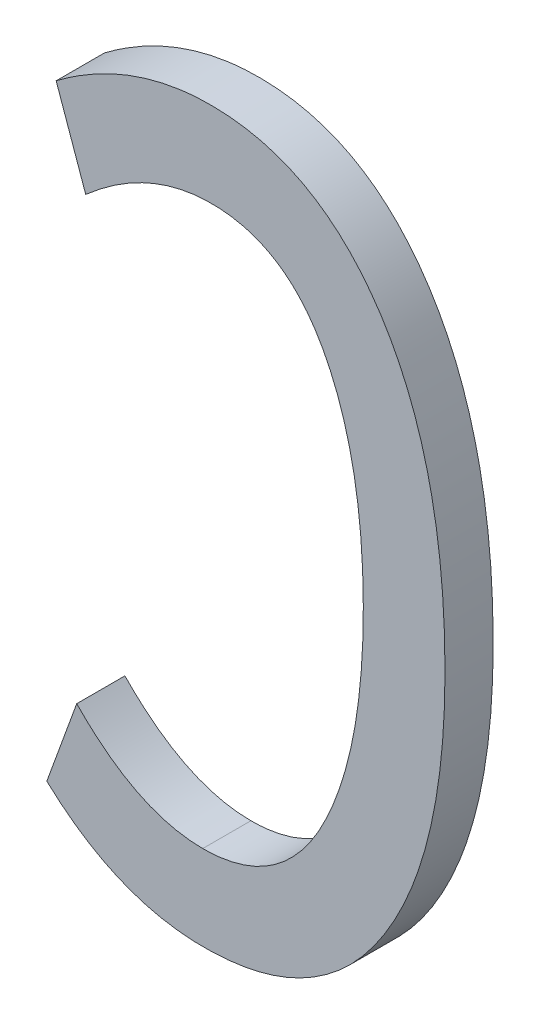
ISO-10303-21;
HEADER;
FILE_DESCRIPTION(('STEP AP214'),'2;1');
FILE_NAME('part.step','',(''),(''),'','','');
FILE_SCHEMA(('AUTOMOTIVE_DESIGN { 1 0 10303 214 1 1 1 1 }'));
ENDSEC;
DATA;
#1=APPLICATION_CONTEXT('core data for automotive mechanical design processes');
#2=APPLICATION_PROTOCOL_DEFINITION('international standard','automotive_design',2000,#1);
#3=PRODUCT_CONTEXT('',#1,'mechanical');
#4=PRODUCT('Part','Part','',(#3));
#5=PRODUCT_RELATED_PRODUCT_CATEGORY('part','',(#4));
#6=PRODUCT_DEFINITION_FORMATION('','',#4);
#7=PRODUCT_DEFINITION_CONTEXT('part definition',#1,'design');
#8=PRODUCT_DEFINITION('design','',#6,#7);
#9=PRODUCT_DEFINITION_SHAPE('','',#8);
#10=(LENGTH_UNIT() NAMED_UNIT(*) SI_UNIT(.MILLI.,.METRE.));
#11=(NAMED_UNIT(*) PLANE_ANGLE_UNIT() SI_UNIT($,.RADIAN.));
#12=(NAMED_UNIT(*) SI_UNIT($,.STERADIAN.) SOLID_ANGLE_UNIT());
#13=UNCERTAINTY_MEASURE_WITH_UNIT(LENGTH_MEASURE(1.E-05),#10,'distance_accuracy_value','');
#14=(GEOMETRIC_REPRESENTATION_CONTEXT(3) GLOBAL_UNCERTAINTY_ASSIGNED_CONTEXT((#13)) GLOBAL_UNIT_ASSIGNED_CONTEXT((#10,
#11,#12)) REPRESENTATION_CONTEXT('',''));
#15=CARTESIAN_POINT('',(0.,0.,0.));
#16=DIRECTION('',(0.,0.,1.));
#17=DIRECTION('',(1.,0.,0.));
#18=AXIS2_PLACEMENT_3D('',#15,#16,#17);
#19=CARTESIAN_POINT('',(172.805521751783,129.433017670428,-39.0997200126349));
#20=DIRECTION('',(0.,0.,1.));
#21=DIRECTION('',(1.,0.,0.));
#22=AXIS2_PLACEMENT_3D('',#19,#20,#21);
#23=PLANE('',#22);
#24=CARTESIAN_POINT('',(173.179290240798,129.551400412619,-39.0997200126349));
#25=CARTESIAN_POINT('',(173.170996397278,129.536869295592,-39.0997200126349));
#26=CARTESIAN_POINT('',(173.161845231683,129.522721943245,-39.0997200126349));
#27=CARTESIAN_POINT('',(173.141542631406,129.495733177779,-39.0997200126349));
#28=CARTESIAN_POINT('',(173.130371730289,129.482906571005,-39.0997200126349));
#29=CARTESIAN_POINT('',(173.107996440082,129.461429210899,-39.0997200126349));
#30=CARTESIAN_POINT('',(173.09712408775,129.45243943104,-39.0997200126349));
#31=CARTESIAN_POINT('',(173.074063033061,129.43645224533,-39.0997200126349));
#32=CARTESIAN_POINT('',(173.061880696716,129.429445755996,-39.0997200126349));
#33=CARTESIAN_POINT('',(173.03642730352,129.41767510984,-39.0997200126349));
#34=CARTESIAN_POINT('',(173.023152695685,129.41291863555,-39.0997200126349));
#35=CARTESIAN_POINT('',(172.995968251824,129.405725073665,-39.0997200126349));
#36=CARTESIAN_POINT('',(172.982057269761,129.403292358241,-39.0997200126349));
#37=CARTESIAN_POINT('',(172.963235823457,129.401444172948,-39.0997200126349));
#38=CARTESIAN_POINT('',(172.958398352693,129.401096106168,-39.0997200126349));
#39=CARTESIAN_POINT('',(172.948730862164,129.40063813394,-39.0997200126349));
#40=CARTESIAN_POINT('',(172.943900886463,129.400527308508,-39.0997200126349));
#41=CARTESIAN_POINT('',(172.939069402692,129.400526934589,-39.0997200126349));
#42=B_SPLINE_CURVE_WITH_KNOTS('',3,(#24,#25,#26,#27,#28,#29,#30,#31,#32,#33,#34,#35,#36,#37,#38,
#39,#40,#41),.UNSPECIFIED.,.F.,.F.,(4,2,2,2,2,2,2,2,4),(0.,0.05031389008783,0.101141419576411,
0.14328190041737,0.185226133827902,0.227312567432882,0.26947803192415,0.284024323659344,
0.298514104230006),.UNSPECIFIED.);
#43=CARTESIAN_POINT('',(173.179290240798,129.551400412619,-39.0997200126349));
#44=VERTEX_POINT('',#43);
#45=CARTESIAN_POINT('',(172.939069402692,129.400526934589,-39.0997200126349));
#46=VERTEX_POINT('',#45);
#47=EDGE_CURVE('E83',#44,#46,#42,.T.);
#48=ORIENTED_EDGE('',*,*,#47,.F.);
#49=CARTESIAN_POINT('',(172.696132012298,130.45505313893,-39.0997200126349));
#50=CARTESIAN_POINT('',(172.715977424237,130.472430632316,-39.0997200126349));
#51=CARTESIAN_POINT('',(172.736966917954,130.488873589954,-39.0997200126349));
#52=CARTESIAN_POINT('',(172.781387339461,130.518439248797,-39.0997200126349));
#53=CARTESIAN_POINT('',(172.804837472868,130.531532591755,-39.0997200126349));
#54=CARTESIAN_POINT('',(172.845849399003,130.549108204501,-39.0997200126349));
#55=CARTESIAN_POINT('',(172.862787196882,130.555006195273,-39.0997200126349));
#56=CARTESIAN_POINT('',(172.897394518877,130.563943597591,-39.0997200126349));
#57=CARTESIAN_POINT('',(172.915062474302,130.566988835488,-39.0997200126349));
#58=CARTESIAN_POINT('',(172.941825179913,130.569149938443,-39.0997200126349));
#59=CARTESIAN_POINT('',(172.950834049455,130.569464737615,-39.0997200126349));
#60=CARTESIAN_POINT('',(172.968844531828,130.569307019316,-39.0997200126349));
#61=CARTESIAN_POINT('',(172.977846142087,130.568834292179,-39.0997200126349));
#62=CARTESIAN_POINT('',(173.004701471082,130.566100173019,-39.0997200126349));
#63=CARTESIAN_POINT('',(173.022457815119,130.56252768912,-39.0997200126349));
#64=CARTESIAN_POINT('',(173.054330524923,130.552153529191,-39.0997200126349));
#65=CARTESIAN_POINT('',(173.068612220338,130.545861573987,-39.0997200126349));
#66=CARTESIAN_POINT('',(173.095572599851,130.530501467663,-39.0997200126349));
#67=CARTESIAN_POINT('',(173.108252704758,130.521435801955,-39.0997200126349));
#68=CARTESIAN_POINT('',(173.132321339685,130.500578544279,-39.0997200126349));
#69=CARTESIAN_POINT('',(173.143603426156,130.488666369591,-39.0997200126349));
#70=CARTESIAN_POINT('',(173.164126723108,130.463177449723,-39.0997200126349));
#71=CARTESIAN_POINT('',(173.173361760457,130.449595856614,-39.0997200126349));
#72=CARTESIAN_POINT('',(173.18903530565,130.423060696962,-39.0997200126349));
#73=CARTESIAN_POINT('',(173.195675314766,130.410222550115,-39.0997200126349));
#74=CARTESIAN_POINT('',(173.207903103503,130.384047987698,-39.0997200126349));
#75=CARTESIAN_POINT('',(173.213489896765,130.370711118931,-39.0997200126349));
#76=CARTESIAN_POINT('',(173.22370616056,130.343647497214,-39.0997200126349));
#77=CARTESIAN_POINT('',(173.228333703103,130.329920020938,-39.0997200126349));
#78=CARTESIAN_POINT('',(173.236729763967,130.302215869105,-39.0997200126349));
#79=CARTESIAN_POINT('',(173.240498688465,130.288239314766,-39.0997200126349));
#80=CARTESIAN_POINT('',(173.250836165972,130.245365573011,-39.0997200126349));
#81=CARTESIAN_POINT('',(173.256201246322,130.21617659608,-39.0997200126349));
#82=CARTESIAN_POINT('',(173.264478991118,130.157449746385,-39.0997200126349));
#83=CARTESIAN_POINT('',(173.267389138051,130.127911546888,-39.0997200126349));
#84=CARTESIAN_POINT('',(173.271264334111,130.068603189204,-39.0997200126349));
#85=CARTESIAN_POINT('',(173.272221926194,130.038832576022,-39.0997200126349));
#86=CARTESIAN_POINT('',(173.272579764032,129.979302967285,-39.0997200126349));
#87=CARTESIAN_POINT('',(173.271980990163,129.949543976222,-39.0997200126349));
#88=CARTESIAN_POINT('',(173.269244255278,129.896254235909,-39.0997200126349));
#89=CARTESIAN_POINT('',(173.26745008454,129.872707755042,-39.0997200126349));
#90=CARTESIAN_POINT('',(173.262473825431,129.82576687883,-39.0997200126349));
#91=CARTESIAN_POINT('',(173.259291429697,129.802372518332,-39.0997200126349));
#92=CARTESIAN_POINT('',(173.247340716155,129.732952829202,-39.0997200126349));
#93=CARTESIAN_POINT('',(173.236155460377,129.687248747981,-39.0997200126349));
#94=CARTESIAN_POINT('',(173.214871542946,129.627389480009,-39.0997200126349));
#95=CARTESIAN_POINT('',(173.208689531894,129.611825830491,-39.0997200126349));
#96=CARTESIAN_POINT('',(173.195010005465,129.581182552988,-39.0997200126349));
#97=CARTESIAN_POINT('',(173.187505086405,129.566106246128,-39.0997200126349));
#98=CARTESIAN_POINT('',(173.179290240798,129.551400412619,-39.0997200126349));
#99=B_SPLINE_CURVE_WITH_KNOTS('',3,(#49,#50,#51,#52,#53,#54,#55,#56,#57,#58,#59,#60,#61,#62,#63,
#64,#65,#66,#67,#68,#69,#70,#71,#72,#73,#74,#75,#76,#77,#78,#79,#80,#81,#82,#83,#84,#85,#86,#87,
#88,#89,#90,#91,#92,#93,#94,#95,#96,#97,#98),.UNSPECIFIED.,.F.,.F.,(4,2,2,2,2,2,2,2,2,2,2,2,2,2,
2,2,2,2,2,2,2,2,2,2,4),(0.,0.0794926130122686,0.159659766234604,0.213259877481706,
0.266750277753252,0.293759772568688,0.320776459402352,0.374655066988543,0.421148854238286,
0.467601101682128,0.516556938196499,0.565658457135838,0.608958064050431,0.65229802268516,
0.695724262956484,0.739129917100609,0.828008168188545,0.916977452718595,1.00628589008307,
1.09553808451181,1.16633896574808,1.23715553074134,1.37746872267186,1.42765768786028,
1.47813701159052),.UNSPECIFIED.);
#100=CARTESIAN_POINT('',(172.696132012298,130.45505313893,-39.0997200126349));
#101=VERTEX_POINT('',#100);
#102=EDGE_CURVE('E24',#101,#44,#99,.T.);
#103=ORIENTED_EDGE('',*,*,#102,.F.);
#104=DIRECTION('',(0.332978858623949,-0.94293429236055,0.));
#105=VECTOR('',#104,1.);
#106=CARTESIAN_POINT('',(172.634815546352,130.628689983821,-39.0997200126349));
#107=LINE('',#106,#105);
#108=CARTESIAN_POINT('',(172.634815546352,130.628689983821,-39.0997200126349));
#109=VERTEX_POINT('',#108);
#110=EDGE_CURVE('E76',#109,#101,#107,.T.);
#111=ORIENTED_EDGE('',*,*,#110,.F.);
#112=CARTESIAN_POINT('',(172.615411601432,129.359764626489,-39.0997200126349));
#113=CARTESIAN_POINT('',(172.627102347977,129.348853992949,-39.0997200126349));
#114=CARTESIAN_POINT('',(172.639213678567,129.338375169599,-39.0997200126349));
#115=CARTESIAN_POINT('',(172.664300510726,129.318451291219,-39.0997200126349));
#116=CARTESIAN_POINT('',(172.677277887423,129.309008604614,-39.0997200126349));
#117=CARTESIAN_POINT('',(172.703982511765,129.291433627446,-39.0997200126349));
#118=CARTESIAN_POINT('',(172.717704486329,129.283293412085,-39.0997200126349));
#119=CARTESIAN_POINT('',(172.745884790361,129.268449078998,-39.0997200126349));
#120=CARTESIAN_POINT('',(172.760342409167,129.261743606671,-39.0997200126349));
#121=CARTESIAN_POINT('',(172.798974293395,129.246302197086,-39.0997200126349));
#122=CARTESIAN_POINT('',(172.823679261503,129.238835783657,-39.0997200126349));
#123=CARTESIAN_POINT('',(172.861399478669,129.230988242734,-39.0997200126349));
#124=CARTESIAN_POINT('',(172.874093797025,129.22893077393,-39.0997200126349));
#125=CARTESIAN_POINT('',(172.899617994574,129.225912511438,-39.0997200126349));
#126=CARTESIAN_POINT('',(172.912447896054,129.224951900967,-39.0997200126349));
#127=CARTESIAN_POINT('',(172.938088297962,129.224078542604,-39.0997200126349));
#128=CARTESIAN_POINT('',(172.950898677858,129.224161709108,-39.0997200126349));
#129=CARTESIAN_POINT('',(172.976482824585,129.225233485656,-39.0997200126349));
#130=CARTESIAN_POINT('',(172.989256587855,129.226222180955,-39.0997200126349));
#131=CARTESIAN_POINT('',(173.014680240865,129.229235990289,-39.0997200126349));
#132=CARTESIAN_POINT('',(173.027330183289,129.231260642099,-39.0997200126349));
#133=CARTESIAN_POINT('',(173.052397774737,129.236408578334,-39.0997200126349));
#134=CARTESIAN_POINT('',(173.064815510822,129.239531441942,-39.0997200126349));
#135=CARTESIAN_POINT('',(173.098391330498,129.249683904416,-39.0997200126349));
#136=CARTESIAN_POINT('',(173.119210122106,129.257893872054,-39.0997200126349));
#137=CARTESIAN_POINT('',(173.159077394389,129.277770569849,-39.0997200126349));
#138=CARTESIAN_POINT('',(173.178128698757,129.289431657175,-39.0997200126349));
#139=CARTESIAN_POINT('',(173.213946329992,129.315701998995,-39.0997200126349));
#140=CARTESIAN_POINT('',(173.230720970132,129.330300016139,-39.0997200126349));
#141=CARTESIAN_POINT('',(173.261949379021,129.361837876116,-39.0997200126349));
#142=CARTESIAN_POINT('',(173.27639743389,129.378783299856,-39.0997200126349));
#143=CARTESIAN_POINT('',(173.300503494218,129.41093236575,-39.0997200126349));
#144=CARTESIAN_POINT('',(173.310549468739,129.425851473069,-39.0997200126349));
#145=CARTESIAN_POINT('',(173.329351624356,129.456485016239,-39.0997200126349));
#146=CARTESIAN_POINT('',(173.338107151467,129.472199849972,-39.0997200126349));
#147=CARTESIAN_POINT('',(173.362454303571,129.520305577403,-39.0997200126349));
#148=CARTESIAN_POINT('',(173.376138797197,129.553674689116,-39.0997200126349));
#149=CARTESIAN_POINT('',(173.396808917178,129.615155899778,-39.0997200126349));
#150=CARTESIAN_POINT('',(173.404581525227,129.643018176409,-39.0997200126349));
#151=CARTESIAN_POINT('',(173.417668214425,129.699329579196,-39.0997200126349));
#152=CARTESIAN_POINT('',(173.422980633507,129.727779088562,-39.0997200126349));
#153=CARTESIAN_POINT('',(173.431539178728,129.785179890371,-39.0997200126349));
#154=CARTESIAN_POINT('',(173.434770521345,129.814133304109,-39.0997200126349));
#155=CARTESIAN_POINT('',(173.439441469451,129.872177601901,-39.0997200126349));
#156=CARTESIAN_POINT('',(173.440881180791,129.90126847773,-39.0997200126349));
#157=CARTESIAN_POINT('',(173.442031924381,129.95087204815,-39.0997200126349));
#158=CARTESIAN_POINT('',(173.442128244399,129.971377613805,-39.0997200126349));
#159=CARTESIAN_POINT('',(173.441687579836,130.012376826386,-39.0997200126349));
#160=CARTESIAN_POINT('',(173.441150712769,130.032870474817,-39.0997200126349));
#161=CARTESIAN_POINT('',(173.438459881371,130.094352936721,-39.0997200126349));
#162=CARTESIAN_POINT('',(173.435224691561,130.135305594083,-39.0997200126349));
#163=CARTESIAN_POINT('',(173.425150954376,130.216425424589,-39.0997200126349));
#164=CARTESIAN_POINT('',(173.41834374941,130.25659632653,-39.0997200126349));
#165=CARTESIAN_POINT('',(173.400132852934,130.335875154526,-39.0997200126349));
#166=CARTESIAN_POINT('',(173.388737778012,130.374984927349,-39.0997200126349));
#167=CARTESIAN_POINT('',(173.36476583389,130.438774292786,-39.0997200126349));
#168=CARTESIAN_POINT('',(173.353756140515,130.464038833592,-39.0997200126349));
#169=CARTESIAN_POINT('',(173.32872127899,130.513009422604,-39.0997200126349));
#170=CARTESIAN_POINT('',(173.31470173445,130.536718271053,-39.0997200126349));
#171=CARTESIAN_POINT('',(173.291307500157,130.570552382167,-39.0997200126349));
#172=CARTESIAN_POINT('',(173.283137086342,130.581518615568,-39.0997200126349));
#173=CARTESIAN_POINT('',(173.265941519928,130.602784032122,-39.0997200126349));
#174=CARTESIAN_POINT('',(173.256915286555,130.613082343405,-39.0997200126349));
#175=CARTESIAN_POINT('',(173.231105304264,130.639998026468,-39.0997200126349));
#176=CARTESIAN_POINT('',(173.213435786045,130.65579334282,-39.0997200126349));
#177=CARTESIAN_POINT('',(173.175556254593,130.683952068562,-39.0997200126349));
#178=CARTESIAN_POINT('',(173.15534997173,130.696320433421,-39.0997200126349));
#179=CARTESIAN_POINT('',(173.113853273143,130.716518292695,-39.0997200126349));
#180=CARTESIAN_POINT('',(173.09264634689,130.724519485282,-39.0997200126349));
#181=CARTESIAN_POINT('',(173.049118383052,130.736668251721,-39.0997200126349));
#182=CARTESIAN_POINT('',(173.026795055511,130.74080753126,-39.0997200126349));
#183=CARTESIAN_POINT('',(172.993480287842,130.744324767518,-39.0997200126349));
#184=CARTESIAN_POINT('',(172.98260751783,130.745058369349,-39.0997200126349));
#185=CARTESIAN_POINT('',(172.960836972706,130.745783800168,-39.0997200126349));
#186=CARTESIAN_POINT('',(172.949939198896,130.745775666913,-39.0997200126349));
#187=CARTESIAN_POINT('',(172.91731769495,130.744609094512,-39.0997200126349));
#188=CARTESIAN_POINT('',(172.895624297567,130.742312787784,-39.0997200126349));
#189=CARTESIAN_POINT('',(172.848516963319,130.733964536134,-39.0997200126349));
#190=CARTESIAN_POINT('',(172.823219506411,130.72725743813,-39.0997200126349));
#191=CARTESIAN_POINT('',(172.773926754268,130.710013718428,-39.0997200126349));
#192=CARTESIAN_POINT('',(172.749934434013,130.699468737091,-39.0997200126349));
#193=CARTESIAN_POINT('',(172.710594560309,130.678923642368,-39.0997200126349));
#194=CARTESIAN_POINT('',(172.694820465231,130.669716714685,-39.0997200126349));
#195=CARTESIAN_POINT('',(172.664169842927,130.65007218301,-39.0997200126349));
#196=CARTESIAN_POINT('',(172.649289102642,130.639641177341,-39.0997200126349));
#197=CARTESIAN_POINT('',(172.634815546352,130.628689983821,-39.0997200126349));
#198=B_SPLINE_CURVE_WITH_KNOTS('',3,(#112,#113,#114,#115,#116,#117,#118,#119,#120,#121,#122,
#123,#124,#125,#126,#127,#128,#129,#130,#131,#132,#133,#134,#135,#136,#137,#138,#139,#140,#141,
#142,#143,#144,#145,#146,#147,#148,#149,#150,#151,#152,#153,#154,#155,#156,#157,#158,#159,#160,
#161,#162,#163,#164,#165,#166,#167,#168,#169,#170,#171,#172,#173,#174,#175,#176,#177,#178,#179,
#180,#181,#182,#183,#184,#185,#186,#187,#188,#189,#190,#191,#192,#193,#194,#195,#196,#197),
.UNSPECIFIED.,.F.,.F.,(4,2,2,2,2,2,2,2,2,2,2,2,2,2,2,2,2,2,2,2,2,2,2,2,2,2,2,2,2,2,2,2,2,2,2,2,
2,2,2,2,2,2,4),(0.,0.0479811026106046,0.0960696919625311,0.143853543425856,0.191592079134592,
0.268551806555653,0.30709356670417,0.345641763837031,0.38403912085095,0.422440093267952,
0.460823946764218,0.499193108119817,0.565984072555403,0.632666426661787,0.699098332306269,
0.765690979184019,0.819578105494183,0.87349244798404,0.981258963260601,1.06792683125728,
1.1546531656623,1.24198898112835,1.32931963640224,1.39082626387543,1.45232147819163,
1.57542475249377,1.69746549458682,1.81927809032281,1.90179344473638,1.98415594859557,
2.02514618531561,2.06618889413283,2.1369414012673,2.20759105789514,2.27521505387907,
2.34298395524303,2.37565601772124,2.40832641704664,2.47354319527494,2.55170868132861,
2.63004545571432,2.68477850793804,2.73922901817548),.UNSPECIFIED.);
#199=CARTESIAN_POINT('',(172.615411601432,129.359764626489,-39.0997200126349));
#200=VERTEX_POINT('',#199);
#201=EDGE_CURVE('E117',#200,#109,#198,.T.);
#202=ORIENTED_EDGE('',*,*,#201,.F.);
#203=DIRECTION('',(-0.342263759081415,-0.939603916136719,0.));
#204=VECTOR('',#203,1.);
#205=CARTESIAN_POINT('',(172.677504225175,129.530225187633,-39.0997200126349));
#206=LINE('',#205,#204);
#207=CARTESIAN_POINT('',(172.677504225175,129.530225187633,-39.0997200126349));
#208=VERTEX_POINT('',#207);
#209=EDGE_CURVE('E175',#208,#200,#206,.T.);
#210=ORIENTED_EDGE('',*,*,#209,.F.);
#211=CARTESIAN_POINT('',(172.939069402692,129.400526934589,-39.0997200126349));
#212=CARTESIAN_POINT('',(172.931044318177,129.400524610765,-39.0997200126349));
#213=CARTESIAN_POINT('',(172.923022205604,129.40086623027,-39.0997200126349));
#214=CARTESIAN_POINT('',(172.907041807233,129.402228482891,-39.0997200126349));
#215=CARTESIAN_POINT('',(172.899083478339,129.403248609992,-39.0997200126349));
#216=CARTESIAN_POINT('',(172.875574287755,129.407279701386,-39.0997200126349));
#217=CARTESIAN_POINT('',(172.860182273989,129.411261972612,-39.0997200126349));
#218=CARTESIAN_POINT('',(172.826109242442,129.422935430201,-39.0997200126349));
#219=CARTESIAN_POINT('',(172.807677999316,129.43134251203,-39.0997200126349));
#220=CARTESIAN_POINT('',(172.772316636063,129.451053032534,-39.0997200126349));
#221=CARTESIAN_POINT('',(172.755397830616,129.462376181521,-39.0997200126349));
#222=CARTESIAN_POINT('',(172.728220456663,129.483187359719,-39.0997200126349));
#223=CARTESIAN_POINT('',(172.717537151694,129.492137261743,-39.0997200126349));
#224=CARTESIAN_POINT('',(172.69697258616,129.51070975616,-39.0997200126349));
#225=CARTESIAN_POINT('',(172.687084070519,129.520324281518,-39.0997200126349));
#226=CARTESIAN_POINT('',(172.677504225175,129.530225187633,-39.0997200126349));
#227=B_SPLINE_CURVE_WITH_KNOTS('',3,(#211,#212,#213,#214,#215,#216,#217,#218,#219,#220,#221,
#222,#223,#224,#225,#226),.UNSPECIFIED.,.F.,.F.,(4,2,2,2,2,2,2,4),(0.,0.024062031020787,
0.0481061372544057,0.0955816565372262,0.156022830099204,0.216883780914317,0.258658204671495,
0.299993169132988),.UNSPECIFIED.);
#228=EDGE_CURVE('E91',#46,#208,#227,.T.);
#229=ORIENTED_EDGE('',*,*,#228,.F.);
#230=EDGE_LOOP('',(#48,#103,#111,#202,#210,#229));
#231=FACE_BOUND('',#230,.T.);
#232=ADVANCED_FACE('F17',(#231),#23,.F.);
#233=CARTESIAN_POINT('',(172.939069402692,129.400526934589,-39.0997200126349));
#234=CARTESIAN_POINT('',(172.939069402692,129.400526934589,-38.9997200126349));
#235=CARTESIAN_POINT('',(172.848258940468,129.400526934589,-39.0997200126349));
#236=CARTESIAN_POINT('',(172.848258940468,129.400526934589,-38.9997200126349));
#237=CARTESIAN_POINT('',(172.76094118833,129.443936145812,-39.0997200126349));
#238=CARTESIAN_POINT('',(172.76094118833,129.443936145812,-38.9997200126349));
#239=CARTESIAN_POINT('',(172.677504225175,129.530225187633,-39.0997200126349));
#240=CARTESIAN_POINT('',(172.677504225175,129.530225187633,-38.9997200126349));
#241=B_SPLINE_SURFACE_WITH_KNOTS('',3,1,((#233,#234),(#235,#236),(#237,#238),(#239,#240)),
.UNSPECIFIED.,.F.,.F.,.F.,(4,4),(2,2),(0.,1.),(1.,1.09999999999999),.UNSPECIFIED.);
#242=DIRECTION('',(0.,0.,1.));
#243=VECTOR('',#242,1.);
#244=CARTESIAN_POINT('',(172.677504225175,129.530225187633,-39.0997200126349));
#245=LINE('',#244,#243);
#246=CARTESIAN_POINT('',(172.677504225175,129.530225187633,-38.9997200126349));
#247=VERTEX_POINT('',#246);
#248=EDGE_CURVE('E93',#247,#208,#245,.F.);
#249=CARTESIAN_POINT('',(172.939069402692,129.400526934589,-38.9997200126349));
#250=CARTESIAN_POINT('',(172.931044318177,129.400524610765,-38.9997200126349));
#251=CARTESIAN_POINT('',(172.923022205604,129.40086623027,-38.9997200126349));
#252=CARTESIAN_POINT('',(172.907041807233,129.402228482891,-38.9997200126349));
#253=CARTESIAN_POINT('',(172.899083478339,129.403248609992,-38.9997200126349));
#254=CARTESIAN_POINT('',(172.875574287755,129.407279701386,-38.9997200126349));
#255=CARTESIAN_POINT('',(172.860182273989,129.411261972612,-38.9997200126349));
#256=CARTESIAN_POINT('',(172.826109242442,129.422935430201,-38.9997200126349));
#257=CARTESIAN_POINT('',(172.807677999316,129.43134251203,-38.9997200126349));
#258=CARTESIAN_POINT('',(172.772316636063,129.451053032534,-38.9997200126349));
#259=CARTESIAN_POINT('',(172.755397830616,129.462376181521,-38.9997200126349));
#260=CARTESIAN_POINT('',(172.728220456663,129.483187359719,-38.9997200126349));
#261=CARTESIAN_POINT('',(172.717537151694,129.492137261743,-38.9997200126349));
#262=CARTESIAN_POINT('',(172.69697258616,129.51070975616,-38.9997200126349));
#263=CARTESIAN_POINT('',(172.687084070519,129.520324281518,-38.9997200126349));
#264=CARTESIAN_POINT('',(172.677504225175,129.530225187633,-38.9997200126349));
#265=B_SPLINE_CURVE_WITH_KNOTS('',3,(#249,#250,#251,#252,#253,#254,#255,#256,#257,#258,#259,
#260,#261,#262,#263,#264),.UNSPECIFIED.,.F.,.F.,(4,2,2,2,2,2,2,4),(0.,0.024062031020787,
0.0481061372544092,0.0955816565372229,0.156022830099201,0.216883780914314,0.258658204671513,
0.299993169132986),.UNSPECIFIED.);
#266=CARTESIAN_POINT('',(172.939069402692,129.400526934589,-38.9997200126349));
#267=VERTEX_POINT('',#266);
#268=EDGE_CURVE('E127',#267,#247,#265,.T.);
#269=DIRECTION('',(0.,0.,1.));
#270=VECTOR('',#269,1.);
#271=CARTESIAN_POINT('',(172.939069402692,129.400526934589,-39.0497200126349));
#272=LINE('',#271,#270);
#273=EDGE_CURVE('E88',#46,#267,#272,.T.);
#274=ORIENTED_EDGE('',*,*,#228,.T.);
#275=ORIENTED_EDGE('',*,*,#248,.F.);
#276=ORIENTED_EDGE('',*,*,#268,.F.);
#277=ORIENTED_EDGE('',*,*,#273,.F.);
#278=EDGE_LOOP('',(#274,#275,#276,#277));
#279=FACE_BOUND('',#278,.T.);
#280=ADVANCED_FACE('F108',(#279),#241,.T.);
#281=CARTESIAN_POINT('',(172.677504225175,129.530225187633,-39.0997200126349));
#282=DIRECTION('',(-0.939603916136719,0.342263759081415,0.));
#283=DIRECTION('',(-0.342263759081415,-0.939603916136719,0.));
#284=AXIS2_PLACEMENT_3D('',#281,#282,#283);
#285=PLANE('',#284);
#286=ORIENTED_EDGE('',*,*,#209,.T.);
#287=DIRECTION('',(0.,0.,-1.));
#288=VECTOR('',#287,1.);
#289=CARTESIAN_POINT('',(172.615411601432,129.359764626489,-39.0497200126349));
#290=LINE('',#289,#288);
#291=CARTESIAN_POINT('',(172.615411601432,129.359764626489,-38.9997200126349));
#292=VERTEX_POINT('',#291);
#293=EDGE_CURVE('E126',#292,#200,#290,.T.);
#294=ORIENTED_EDGE('',*,*,#293,.F.);
#295=DIRECTION('',(-0.342263759081476,-0.939603916136697,0.));
#296=VECTOR('',#295,1.);
#297=CARTESIAN_POINT('',(172.677504225175,129.530225187633,-38.9997200126349));
#298=LINE('',#297,#296);
#299=EDGE_CURVE('E158',#247,#292,#298,.T.);
#300=ORIENTED_EDGE('',*,*,#299,.F.);
#301=ORIENTED_EDGE('',*,*,#248,.T.);
#302=EDGE_LOOP('',(#286,#294,#300,#301));
#303=FACE_BOUND('',#302,.T.);
#304=ADVANCED_FACE('F109',(#303),#285,.T.);
#305=CARTESIAN_POINT('',(172.615411601432,129.359764626489,-39.0997200126349));
#306=CARTESIAN_POINT('',(172.615411601432,129.359764626489,-38.9997200126349));
#307=CARTESIAN_POINT('',(172.712431326031,129.269240539671,-39.0997200126349));
#308=CARTESIAN_POINT('',(172.712431326031,129.269240539671,-38.9997200126349));
#309=CARTESIAN_POINT('',(172.821093417581,129.224243186574,-39.0997200126349));
#310=CARTESIAN_POINT('',(172.821093417581,129.224243186574,-38.9997200126349));
#311=CARTESIAN_POINT('',(173.095853277643,129.224243186574,-39.0997200126349));
#312=CARTESIAN_POINT('',(173.095853277643,129.224243186574,-38.9997200126349));
#313=CARTESIAN_POINT('',(173.216933893942,129.288298242159,-39.0997200126349));
#314=CARTESIAN_POINT('',(173.216933893942,129.288298242159,-38.9997200126349));
#315=CARTESIAN_POINT('',(173.396522663446,129.552787827192,-39.0997200126349));
#316=CARTESIAN_POINT('',(173.396522663446,129.552787827192,-38.9997200126349));
#317=CARTESIAN_POINT('',(173.44201965501,129.737213011878,-39.0997200126349));
#318=CARTESIAN_POINT('',(173.44201965501,129.737213011878,-38.9997200126349));
#319=CARTESIAN_POINT('',(173.44201965501,130.227419470322,-39.0997200126349));
#320=CARTESIAN_POINT('',(173.44201965501,130.227419470322,-38.9997200126349));
#321=CARTESIAN_POINT('',(173.393509792711,130.425407823948,-39.0997200126349));
#322=CARTESIAN_POINT('',(173.393509792711,130.425407823948,-38.9997200126349));
#323=CARTESIAN_POINT('',(173.210922746874,130.6843988768,-39.0997200126349));
#324=CARTESIAN_POINT('',(173.210922746874,130.6843988768,-38.9997200126349));
#325=CARTESIAN_POINT('',(173.097793672135,130.745683101873,-39.0997200126349));
#326=CARTESIAN_POINT('',(173.097793672135,130.745683101873,-38.9997200126349));
#327=CARTESIAN_POINT('',(172.844766230383,130.745683101873,-39.0997200126349));
#328=CARTESIAN_POINT('',(172.844766230383,130.745683101873,-38.9997200126349));
#329=CARTESIAN_POINT('',(172.737656454426,130.706508935647,-39.0997200126349));
#330=CARTESIAN_POINT('',(172.737656454426,130.706508935647,-38.9997200126349));
#331=CARTESIAN_POINT('',(172.634815546352,130.628689983821,-39.0997200126349));
#332=CARTESIAN_POINT('',(172.634815546352,130.628689983821,-38.9997200126349));
#333=B_SPLINE_SURFACE_WITH_KNOTS('',3,1,((#305,#306),(#307,#308),(#309,#310),(#311,#312),(#313,
#314),(#315,#316),(#317,#318),(#319,#320),(#321,#322),(#323,#324),(#325,#326),(#327,#328),(#329,
#330),(#331,#332)),.UNSPECIFIED.,.F.,.F.,.F.,(4,2,2,2,2,2,4),(2,2),(0.,0.134909189188642,
0.308115180469532,0.489570338590206,0.689129866228594,0.863636720462226,1.),(1.,
1.09999999999999),.UNSPECIFIED.);
#334=DIRECTION('',(0.,0.,1.));
#335=VECTOR('',#334,1.);
#336=CARTESIAN_POINT('',(172.634815546352,130.628689983821,-39.0997200126349));
#337=LINE('',#336,#335);
#338=CARTESIAN_POINT('',(172.634815546352,130.628689983821,-38.9997200126349));
#339=VERTEX_POINT('',#338);
#340=EDGE_CURVE('E125',#339,#109,#337,.F.);
#341=CARTESIAN_POINT('',(172.615411601432,129.359764626489,-38.9997200126349));
#342=CARTESIAN_POINT('',(172.627102347977,129.348853992949,-38.9997200126349));
#343=CARTESIAN_POINT('',(172.639213678567,129.338375169599,-38.9997200126349));
#344=CARTESIAN_POINT('',(172.664300510726,129.318451291219,-38.9997200126349));
#345=CARTESIAN_POINT('',(172.677277887423,129.309008604614,-38.9997200126349));
#346=CARTESIAN_POINT('',(172.703982511765,129.291433627446,-38.9997200126349));
#347=CARTESIAN_POINT('',(172.717704486329,129.283293412085,-38.9997200126349));
#348=CARTESIAN_POINT('',(172.745884790361,129.268449078998,-38.9997200126349));
#349=CARTESIAN_POINT('',(172.760342409167,129.261743606671,-38.9997200126349));
#350=CARTESIAN_POINT('',(172.798974293395,129.246302197086,-38.9997200126349));
#351=CARTESIAN_POINT('',(172.823679261503,129.238835783657,-38.9997200126349));
#352=CARTESIAN_POINT('',(172.861399478669,129.230988242734,-38.9997200126349));
#353=CARTESIAN_POINT('',(172.874093797025,129.22893077393,-38.9997200126349));
#354=CARTESIAN_POINT('',(172.899617994575,129.225912511438,-38.9997200126349));
#355=CARTESIAN_POINT('',(172.912447896054,129.224951900967,-38.9997200126349));
#356=CARTESIAN_POINT('',(172.938088297962,129.224078542604,-38.9997200126349));
#357=CARTESIAN_POINT('',(172.950898677859,129.224161709108,-38.9997200126349));
#358=CARTESIAN_POINT('',(172.976482824586,129.225233485656,-38.9997200126349));
#359=CARTESIAN_POINT('',(172.989256587855,129.226222180955,-38.9997200126349));
#360=CARTESIAN_POINT('',(173.014680240865,129.229235990289,-38.9997200126349));
#361=CARTESIAN_POINT('',(173.02733018329,129.231260642099,-38.9997200126349));
#362=CARTESIAN_POINT('',(173.052397774737,129.236408578334,-38.9997200126349));
#363=CARTESIAN_POINT('',(173.064815510823,129.239531441942,-38.9997200126349));
#364=CARTESIAN_POINT('',(173.098391330498,129.249683904416,-38.9997200126349));
#365=CARTESIAN_POINT('',(173.119210122107,129.257893872054,-38.9997200126349));
#366=CARTESIAN_POINT('',(173.15907739439,129.277770569849,-38.9997200126349));
#367=CARTESIAN_POINT('',(173.178128698757,129.289431657175,-38.9997200126349));
#368=CARTESIAN_POINT('',(173.213946329992,129.315701998995,-38.9997200126349));
#369=CARTESIAN_POINT('',(173.230720970132,129.330300016139,-38.9997200126349));
#370=CARTESIAN_POINT('',(173.261949379022,129.361837876116,-38.9997200126349));
#371=CARTESIAN_POINT('',(173.27639743389,129.378783299856,-38.9997200126349));
#372=CARTESIAN_POINT('',(173.300503494218,129.41093236575,-38.9997200126349));
#373=CARTESIAN_POINT('',(173.310549468739,129.42585147307,-38.9997200126349));
#374=CARTESIAN_POINT('',(173.329351624356,129.456485016239,-38.9997200126349));
#375=CARTESIAN_POINT('',(173.338107151467,129.472199849972,-38.9997200126349));
#376=CARTESIAN_POINT('',(173.362454303572,129.520305577403,-38.9997200126349));
#377=CARTESIAN_POINT('',(173.376138797197,129.553674689117,-38.9997200126349));
#378=CARTESIAN_POINT('',(173.396808917178,129.615155899778,-38.9997200126349));
#379=CARTESIAN_POINT('',(173.404581525227,129.64301817641,-38.9997200126349));
#380=CARTESIAN_POINT('',(173.417668214425,129.699329579197,-38.9997200126349));
#381=CARTESIAN_POINT('',(173.422980633507,129.727779088562,-38.9997200126349));
#382=CARTESIAN_POINT('',(173.431539178728,129.785179890372,-38.9997200126349));
#383=CARTESIAN_POINT('',(173.434770521346,129.81413330411,-38.9997200126349));
#384=CARTESIAN_POINT('',(173.439441469451,129.872177601902,-38.9997200126349));
#385=CARTESIAN_POINT('',(173.440881180791,129.901268477732,-38.9997200126349));
#386=CARTESIAN_POINT('',(173.442031924381,129.950872048151,-38.9997200126349));
#387=CARTESIAN_POINT('',(173.442128244399,129.971377613806,-38.9997200126349));
#388=CARTESIAN_POINT('',(173.441687579836,130.012376826387,-38.9997200126349));
#389=CARTESIAN_POINT('',(173.441150712769,130.032870474818,-38.9997200126349));
#390=CARTESIAN_POINT('',(173.438459881371,130.094352936722,-38.9997200126349));
#391=CARTESIAN_POINT('',(173.435224691561,130.135305594084,-38.9997200126349));
#392=CARTESIAN_POINT('',(173.425150954375,130.216425424589,-38.9997200126349));
#393=CARTESIAN_POINT('',(173.41834374941,130.25659632653,-38.9997200126349));
#394=CARTESIAN_POINT('',(173.400132852934,130.335875154525,-38.9997200126349));
#395=CARTESIAN_POINT('',(173.388737778013,130.374984927348,-38.9997200126349));
#396=CARTESIAN_POINT('',(173.36476583389,130.438774292785,-38.9997200126349));
#397=CARTESIAN_POINT('',(173.353756140516,130.464038833591,-38.9997200126349));
#398=CARTESIAN_POINT('',(173.32872127899,130.513009422603,-38.9997200126349));
#399=CARTESIAN_POINT('',(173.314701734451,130.536718271053,-38.9997200126349));
#400=CARTESIAN_POINT('',(173.291307500157,130.570552382166,-38.9997200126349));
#401=CARTESIAN_POINT('',(173.283137086343,130.581518615568,-38.9997200126349));
#402=CARTESIAN_POINT('',(173.265941519928,130.602784032121,-38.9997200126349));
#403=CARTESIAN_POINT('',(173.256915286555,130.613082343404,-38.9997200126349));
#404=CARTESIAN_POINT('',(173.231105304265,130.639998026468,-38.9997200126349));
#405=CARTESIAN_POINT('',(173.213435786045,130.655793342819,-38.9997200126349));
#406=CARTESIAN_POINT('',(173.175556254593,130.683952068562,-38.9997200126349));
#407=CARTESIAN_POINT('',(173.15534997173,130.696320433421,-38.9997200126349));
#408=CARTESIAN_POINT('',(173.113853273143,130.716518292694,-38.9997200126349));
#409=CARTESIAN_POINT('',(173.09264634689,130.724519485282,-38.9997200126349));
#410=CARTESIAN_POINT('',(173.049118383052,130.736668251721,-38.9997200126349));
#411=CARTESIAN_POINT('',(173.026795055511,130.74080753126,-38.9997200126349));
#412=CARTESIAN_POINT('',(172.993480287843,130.744324767518,-38.9997200126349));
#413=CARTESIAN_POINT('',(172.98260751783,130.745058369349,-38.9997200126349));
#414=CARTESIAN_POINT('',(172.960836972707,130.745783800168,-38.9997200126349));
#415=CARTESIAN_POINT('',(172.949939198897,130.745775666913,-38.9997200126349));
#416=CARTESIAN_POINT('',(172.91731769495,130.744609094512,-38.9997200126349));
#417=CARTESIAN_POINT('',(172.895624297567,130.742312787784,-38.9997200126349));
#418=CARTESIAN_POINT('',(172.848516963319,130.733964536134,-38.9997200126349));
#419=CARTESIAN_POINT('',(172.823219506411,130.72725743813,-38.9997200126349));
#420=CARTESIAN_POINT('',(172.773926754268,130.710013718428,-38.9997200126349));
#421=CARTESIAN_POINT('',(172.749934434013,130.699468737091,-38.9997200126349));
#422=CARTESIAN_POINT('',(172.710594560309,130.678923642368,-38.9997200126349));
#423=CARTESIAN_POINT('',(172.694820465231,130.669716714685,-38.9997200126349));
#424=CARTESIAN_POINT('',(172.664169842927,130.65007218301,-38.9997200126349));
#425=CARTESIAN_POINT('',(172.649289102642,130.639641177341,-38.9997200126349));
#426=CARTESIAN_POINT('',(172.634815546352,130.628689983821,-38.9997200126349));
#427=B_SPLINE_CURVE_WITH_KNOTS('',3,(#341,#342,#343,#344,#345,#346,#347,#348,#349,#350,#351,
#352,#353,#354,#355,#356,#357,#358,#359,#360,#361,#362,#363,#364,#365,#366,#367,#368,#369,#370,
#371,#372,#373,#374,#375,#376,#377,#378,#379,#380,#381,#382,#383,#384,#385,#386,#387,#388,#389,
#390,#391,#392,#393,#394,#395,#396,#397,#398,#399,#400,#401,#402,#403,#404,#405,#406,#407,#408,
#409,#410,#411,#412,#413,#414,#415,#416,#417,#418,#419,#420,#421,#422,#423,#424,#425,#426),
.UNSPECIFIED.,.F.,.F.,(4,2,2,2,2,2,2,2,2,2,2,2,2,2,2,2,2,2,2,2,2,2,2,2,2,2,2,2,2,2,2,2,2,2,2,2,
2,2,2,2,2,2,4),(0.,0.0479811026106227,0.0960696919625818,0.143853543425884,0.191592079134631,
0.268551806555727,0.307093566704303,0.345641763837192,0.384039120851139,0.422440093268228,
0.460823946764545,0.499193108120217,0.565984072555819,0.63266642666217,0.69909833230665,
0.765690979184366,0.819578105494515,0.873492447984385,0.981258963260884,1.06792683125779,
1.15465316566305,1.2419889811294,1.32931963640357,1.3908262638765,1.4523214781924,
1.57542475249402,1.69746549458654,1.81927809032199,1.9017934447356,1.98415594859487,
2.02514618531502,2.06618889413229,2.13694140126698,2.20759105789509,2.27521505387894,
2.34298395524282,2.37565601772106,2.40832641704646,2.47354319527482,2.55170868132856,
2.63004545571435,2.68477850793801,2.73922901817544),.UNSPECIFIED.);
#428=EDGE_CURVE('E150',#292,#339,#427,.T.);
#429=ORIENTED_EDGE('',*,*,#201,.T.);
#430=ORIENTED_EDGE('',*,*,#340,.F.);
#431=ORIENTED_EDGE('',*,*,#428,.F.);
#432=ORIENTED_EDGE('',*,*,#293,.T.);
#433=EDGE_LOOP('',(#429,#430,#431,#432));
#434=FACE_BOUND('',#433,.T.);
#435=ADVANCED_FACE('F134',(#434),#333,.T.);
#436=CARTESIAN_POINT('',(172.634815546352,130.628689983821,-39.0997200126349));
#437=DIRECTION('',(-0.942934292360562,-0.332978858623918,0.));
#438=DIRECTION('',(0.332978858623918,-0.942934292360562,0.));
#439=AXIS2_PLACEMENT_3D('',#436,#437,#438);
#440=PLANE('',#439);
#441=ORIENTED_EDGE('',*,*,#110,.T.);
#442=DIRECTION('',(0.,0.,-1.));
#443=VECTOR('',#442,1.);
#444=CARTESIAN_POINT('',(172.696132012298,130.45505313893,-39.0497200126349));
#445=LINE('',#444,#443);
#446=CARTESIAN_POINT('',(172.696132012298,130.45505313893,-38.9997200126349));
#447=VERTEX_POINT('',#446);
#448=EDGE_CURVE('E80',#447,#101,#445,.T.);
#449=ORIENTED_EDGE('',*,*,#448,.F.);
#450=DIRECTION('',(0.332978858623949,-0.94293429236055,0.));
#451=VECTOR('',#450,1.);
#452=CARTESIAN_POINT('',(172.634815546352,130.628689983821,-38.9997200126349));
#453=LINE('',#452,#451);
#454=EDGE_CURVE('E157',#339,#447,#453,.T.);
#455=ORIENTED_EDGE('',*,*,#454,.F.);
#456=ORIENTED_EDGE('',*,*,#340,.T.);
#457=EDGE_LOOP('',(#441,#449,#455,#456));
#458=FACE_BOUND('',#457,.T.);
#459=ADVANCED_FACE('F139',(#458),#440,.T.);
#460=CARTESIAN_POINT('',(172.696132012298,130.45505313893,-39.0997200126349));
#461=CARTESIAN_POINT('',(172.696132012298,130.45505313893,-38.9997200126349));
#462=CARTESIAN_POINT('',(172.783061685538,130.531283948882,-39.0997200126349));
#463=CARTESIAN_POINT('',(172.783061685538,130.531283948882,-38.9997200126349));
#464=CARTESIAN_POINT('',(172.869991358778,130.569399353858,-39.0997200126349));
#465=CARTESIAN_POINT('',(172.869991358778,130.569399353858,-38.9997200126349));
#466=CARTESIAN_POINT('',(173.061702334585,130.569399353858,-39.0997200126349));
#467=CARTESIAN_POINT('',(173.061702334585,130.569399353858,-38.9997200126349));
#468=CARTESIAN_POINT('',(173.140482350959,130.517520052641,-39.0997200126349));
#469=CARTESIAN_POINT('',(173.140482350959,130.517520052641,-38.9997200126349));
#470=CARTESIAN_POINT('',(173.246010017091,130.311575717337,-39.0997200126349));
#471=CARTESIAN_POINT('',(173.246010017091,130.311575717337,-38.9997200126349));
#472=CARTESIAN_POINT('',(173.272429176412,130.172893265981,-39.0997200126349));
#473=CARTESIAN_POINT('',(173.272429176412,130.172893265981,-38.9997200126349));
#474=CARTESIAN_POINT('',(173.272429176412,129.811855679957,-39.0997200126349));
#475=CARTESIAN_POINT('',(173.272429176412,129.811855679957,-38.9997200126349));
#476=CARTESIAN_POINT('',(173.241382864541,129.6625703438,-39.0997200126349));
#477=CARTESIAN_POINT('',(173.241382864541,129.6625703438,-38.9997200126349));
#478=CARTESIAN_POINT('',(173.179290240798,129.551400412619,-39.0997200126349));
#479=CARTESIAN_POINT('',(173.179290240798,129.551400412619,-38.9997200126349));
#480=B_SPLINE_SURFACE_WITH_KNOTS('',3,1,((#460,#461),(#462,#463),(#464,#465),(#466,#467),(#468,
#469),(#470,#471),(#472,#473),(#474,#475),(#476,#477),(#478,#479)),.UNSPECIFIED.,.F.,.F.,.F.,(4,
2,2,2,4),(2,2),(0.,0.213966638351292,0.471872854221153,0.725869487381652,1.),(1.,
1.09999999999999),.UNSPECIFIED.);
#481=DIRECTION('',(0.,0.,-1.));
#482=VECTOR('',#481,1.);
#483=CARTESIAN_POINT('',(173.179290240798,129.551400412619,-39.0497200126349));
#484=LINE('',#483,#482);
#485=CARTESIAN_POINT('',(173.179290240798,129.551400412619,-38.9997200126349));
#486=VERTEX_POINT('',#485);
#487=EDGE_CURVE('E44',#486,#44,#484,.T.);
#488=CARTESIAN_POINT('',(172.696132012298,130.45505313893,-38.9997200126349));
#489=CARTESIAN_POINT('',(172.715977424237,130.472430632316,-38.9997200126349));
#490=CARTESIAN_POINT('',(172.736966917954,130.488873589955,-38.9997200126349));
#491=CARTESIAN_POINT('',(172.781387339461,130.518439248797,-38.9997200126349));
#492=CARTESIAN_POINT('',(172.804837472868,130.531532591755,-38.9997200126349));
#493=CARTESIAN_POINT('',(172.845849399003,130.549108204501,-38.9997200126349));
#494=CARTESIAN_POINT('',(172.862787196882,130.555006195273,-38.9997200126349));
#495=CARTESIAN_POINT('',(172.897394518877,130.563943597591,-38.9997200126349));
#496=CARTESIAN_POINT('',(172.915062474302,130.566988835488,-38.9997200126349));
#497=CARTESIAN_POINT('',(172.941825179913,130.569149938443,-38.9997200126349));
#498=CARTESIAN_POINT('',(172.950834049455,130.569464737615,-38.9997200126349));
#499=CARTESIAN_POINT('',(172.968844531828,130.569307019316,-38.9997200126349));
#500=CARTESIAN_POINT('',(172.977846142087,130.568834292179,-38.9997200126349));
#501=CARTESIAN_POINT('',(173.004701471082,130.566100173019,-38.9997200126349));
#502=CARTESIAN_POINT('',(173.022457815119,130.56252768912,-38.9997200126349));
#503=CARTESIAN_POINT('',(173.054330524923,130.552153529191,-38.9997200126349));
#504=CARTESIAN_POINT('',(173.068612220338,130.545861573987,-38.9997200126349));
#505=CARTESIAN_POINT('',(173.095572599851,130.530501467663,-38.9997200126349));
#506=CARTESIAN_POINT('',(173.108252704758,130.521435801955,-38.9997200126349));
#507=CARTESIAN_POINT('',(173.132321339685,130.500578544279,-38.9997200126349));
#508=CARTESIAN_POINT('',(173.143603426156,130.488666369591,-38.9997200126349));
#509=CARTESIAN_POINT('',(173.164126723108,130.463177449723,-38.9997200126349));
#510=CARTESIAN_POINT('',(173.173361760457,130.449595856614,-38.9997200126349));
#511=CARTESIAN_POINT('',(173.18903530565,130.423060696962,-38.9997200126349));
#512=CARTESIAN_POINT('',(173.195675314766,130.410222550115,-38.9997200126349));
#513=CARTESIAN_POINT('',(173.207903103503,130.384047987698,-38.9997200126349));
#514=CARTESIAN_POINT('',(173.213489896765,130.370711118931,-38.9997200126349));
#515=CARTESIAN_POINT('',(173.22370616056,130.343647497214,-38.9997200126349));
#516=CARTESIAN_POINT('',(173.228333703104,130.329920020938,-38.9997200126349));
#517=CARTESIAN_POINT('',(173.236729763967,130.302215869105,-38.9997200126349));
#518=CARTESIAN_POINT('',(173.240498688465,130.288239314766,-38.9997200126349));
#519=CARTESIAN_POINT('',(173.250836165972,130.245365573011,-38.9997200126349));
#520=CARTESIAN_POINT('',(173.256201246322,130.21617659608,-38.9997200126349));
#521=CARTESIAN_POINT('',(173.264478991118,130.157449746385,-38.9997200126349));
#522=CARTESIAN_POINT('',(173.267389138051,130.127911546888,-38.9997200126349));
#523=CARTESIAN_POINT('',(173.271264334111,130.068603189204,-38.9997200126349));
#524=CARTESIAN_POINT('',(173.272221926194,130.038832576022,-38.9997200126349));
#525=CARTESIAN_POINT('',(173.272579764032,129.979302967285,-38.9997200126349));
#526=CARTESIAN_POINT('',(173.271980990163,129.949543976222,-38.9997200126349));
#527=CARTESIAN_POINT('',(173.269244255278,129.89625423591,-38.9997200126349));
#528=CARTESIAN_POINT('',(173.26745008454,129.872707755042,-38.9997200126349));
#529=CARTESIAN_POINT('',(173.262473825431,129.825766878831,-38.9997200126349));
#530=CARTESIAN_POINT('',(173.259291429697,129.802372518332,-38.9997200126349));
#531=CARTESIAN_POINT('',(173.247340716155,129.732952829202,-38.9997200126349));
#532=CARTESIAN_POINT('',(173.236155460377,129.687248747981,-38.9997200126349));
#533=CARTESIAN_POINT('',(173.214871542946,129.627389480009,-38.9997200126349));
#534=CARTESIAN_POINT('',(173.208689531894,129.611825830491,-38.9997200126349));
#535=CARTESIAN_POINT('',(173.195010005465,129.581182552988,-38.9997200126349));
#536=CARTESIAN_POINT('',(173.187505086405,129.566106246128,-38.9997200126349));
#537=CARTESIAN_POINT('',(173.179290240798,129.551400412619,-38.9997200126349));
#538=B_SPLINE_CURVE_WITH_KNOTS('',3,(#488,#489,#490,#491,#492,#493,#494,#495,#496,#497,#498,
#499,#500,#501,#502,#503,#504,#505,#506,#507,#508,#509,#510,#511,#512,#513,#514,#515,#516,#517,
#518,#519,#520,#521,#522,#523,#524,#525,#526,#527,#528,#529,#530,#531,#532,#533,#534,#535,#536,
#537),.UNSPECIFIED.,.F.,.F.,(4,2,2,2,2,2,2,2,2,2,2,2,2,2,2,2,2,2,2,2,2,2,2,2,4),(0.,
0.0794926130122855,0.159659766234607,0.2132598774817,0.266750277753251,0.293759772568686,
0.320776459402347,0.374655066988533,0.421148854238265,0.467601101682122,0.516556938196494,
0.565658457135833,0.608958064050438,0.652298022685162,0.695724262956486,0.73912991710059,
0.828008168188482,0.916977452718559,1.00628589008298,1.09553808451172,1.16633896574799,
1.23715553074128,1.37746872267182,1.42765768786028,1.47813701159051),.UNSPECIFIED.);
#539=EDGE_CURVE('E35',#447,#486,#538,.T.);
#540=ORIENTED_EDGE('',*,*,#102,.T.);
#541=ORIENTED_EDGE('',*,*,#487,.F.);
#542=ORIENTED_EDGE('',*,*,#539,.F.);
#543=ORIENTED_EDGE('',*,*,#448,.T.);
#544=EDGE_LOOP('',(#540,#541,#542,#543));
#545=FACE_BOUND('',#544,.T.);
#546=ADVANCED_FACE('F79',(#545),#480,.T.);
#547=CARTESIAN_POINT('',(173.179290240798,129.551400412619,-39.0997200126349));
#548=CARTESIAN_POINT('',(173.179290240798,129.551400412619,-38.9997200126349));
#549=CARTESIAN_POINT('',(173.121854563836,129.450818093932,-39.0997200126349));
#550=CARTESIAN_POINT('',(173.121854563836,129.450818093932,-38.9997200126349));
#551=CARTESIAN_POINT('',(173.041910310767,129.400526934589,-39.0997200126349));
#552=CARTESIAN_POINT('',(173.041910310767,129.400526934589,-38.9997200126349));
#553=CARTESIAN_POINT('',(172.939069402692,129.400526934589,-39.0997200126349));
#554=CARTESIAN_POINT('',(172.939069402692,129.400526934589,-38.9997200126349));
#555=B_SPLINE_SURFACE_WITH_KNOTS('',3,1,((#547,#548),(#549,#550),(#551,#552),(#553,#554)),
.UNSPECIFIED.,.F.,.F.,.F.,(4,4),(2,2),(0.,1.),(1.,1.09999999999999),.UNSPECIFIED.);
#556=CARTESIAN_POINT('',(173.179290240798,129.551400412619,-38.9997200126349));
#557=CARTESIAN_POINT('',(173.170996397278,129.536869295592,-38.9997200126349));
#558=CARTESIAN_POINT('',(173.161845231683,129.522721943245,-38.9997200126349));
#559=CARTESIAN_POINT('',(173.141542631406,129.495733177779,-38.9997200126349));
#560=CARTESIAN_POINT('',(173.130371730289,129.482906571005,-38.9997200126349));
#561=CARTESIAN_POINT('',(173.107996440082,129.461429210899,-38.9997200126349));
#562=CARTESIAN_POINT('',(173.09712408775,129.45243943104,-38.9997200126349));
#563=CARTESIAN_POINT('',(173.074063033061,129.43645224533,-38.9997200126349));
#564=CARTESIAN_POINT('',(173.061880696716,129.429445755996,-38.9997200126349));
#565=CARTESIAN_POINT('',(173.03642730352,129.41767510984,-38.9997200126349));
#566=CARTESIAN_POINT('',(173.023152695685,129.41291863555,-38.9997200126349));
#567=CARTESIAN_POINT('',(172.995968251824,129.405725073665,-38.9997200126349));
#568=CARTESIAN_POINT('',(172.982057269761,129.403292358241,-38.9997200126349));
#569=CARTESIAN_POINT('',(172.963235823457,129.401444172948,-38.9997200126349));
#570=CARTESIAN_POINT('',(172.958398352693,129.401096106168,-38.9997200126349));
#571=CARTESIAN_POINT('',(172.948730862164,129.40063813394,-38.9997200126349));
#572=CARTESIAN_POINT('',(172.943900886463,129.400527308508,-38.9997200126349));
#573=CARTESIAN_POINT('',(172.939069402692,129.400526934589,-38.9997200126349));
#574=B_SPLINE_CURVE_WITH_KNOTS('',3,(#556,#557,#558,#559,#560,#561,#562,#563,#564,#565,#566,
#567,#568,#569,#570,#571,#572,#573),.UNSPECIFIED.,.F.,.F.,(4,2,2,2,2,2,2,2,4),(0.,
0.05031389008783,0.101141419576411,0.143281900417374,0.185226133827895,0.227312567432875,
0.269478031924144,0.284024323659337,0.298514104229999),.UNSPECIFIED.);
#575=EDGE_CURVE('E11',#486,#267,#574,.T.);
#576=ORIENTED_EDGE('',*,*,#47,.T.);
#577=ORIENTED_EDGE('',*,*,#273,.T.);
#578=ORIENTED_EDGE('',*,*,#575,.F.);
#579=ORIENTED_EDGE('',*,*,#487,.T.);
#580=EDGE_LOOP('',(#576,#577,#578,#579));
#581=FACE_BOUND('',#580,.T.);
#582=ADVANCED_FACE('F19',(#581),#555,.T.);
#583=CARTESIAN_POINT('',(172.805521751783,129.433017670428,-38.9997200126349));
#584=DIRECTION('',(0.,0.,1.));
#585=DIRECTION('',(1.,0.,0.));
#586=AXIS2_PLACEMENT_3D('',#583,#584,#585);
#587=PLANE('',#586);
#588=ORIENTED_EDGE('',*,*,#539,.T.);
#589=ORIENTED_EDGE('',*,*,#575,.T.);
#590=ORIENTED_EDGE('',*,*,#268,.T.);
#591=ORIENTED_EDGE('',*,*,#299,.T.);
#592=ORIENTED_EDGE('',*,*,#428,.T.);
#593=ORIENTED_EDGE('',*,*,#454,.T.);
#594=EDGE_LOOP('',(#588,#589,#590,#591,#592,#593));
#595=FACE_BOUND('',#594,.T.);
#596=ADVANCED_FACE('F163',(#595),#587,.T.);
#597=CLOSED_SHELL('',(#232,#280,#304,#435,#459,#546,#582,#596));
#598=MANIFOLD_SOLID_BREP('B1',#597);
#599=ADVANCED_BREP_SHAPE_REPRESENTATION('',(#18,#598),#14);
#600=SHAPE_DEFINITION_REPRESENTATION(#9,#599);
ENDSEC;
END-ISO-10303-21;
